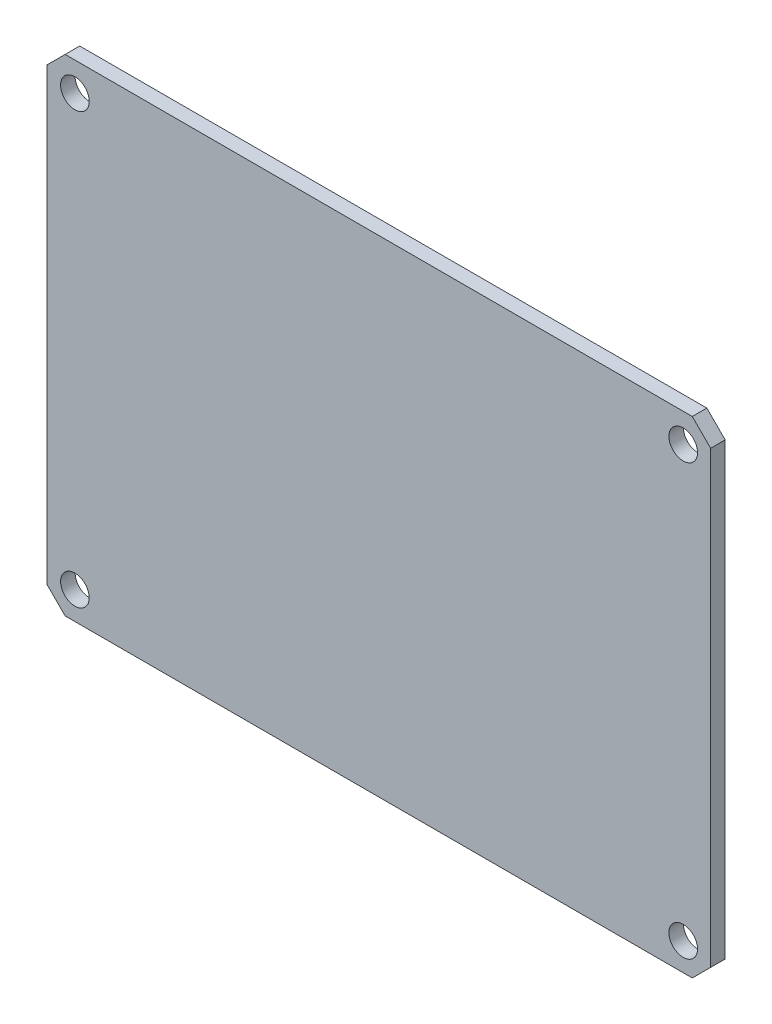
ISO-10303-21;
HEADER;
FILE_DESCRIPTION(('STEP AP214'),'2;1');
FILE_NAME('part.step','',(''),(''),'','','');
FILE_SCHEMA(('AUTOMOTIVE_DESIGN { 1 0 10303 214 1 1 1 1 }'));
ENDSEC;
DATA;
#1=APPLICATION_CONTEXT('core data for automotive mechanical design processes');
#2=APPLICATION_PROTOCOL_DEFINITION('international standard','automotive_design',2000,#1);
#3=PRODUCT_CONTEXT('',#1,'mechanical');
#4=PRODUCT('Part','Part','',(#3));
#5=PRODUCT_RELATED_PRODUCT_CATEGORY('part','',(#4));
#6=PRODUCT_DEFINITION_FORMATION('','',#4);
#7=PRODUCT_DEFINITION_CONTEXT('part definition',#1,'design');
#8=PRODUCT_DEFINITION('design','',#6,#7);
#9=PRODUCT_DEFINITION_SHAPE('','',#8);
#10=(LENGTH_UNIT() NAMED_UNIT(*) SI_UNIT(.MILLI.,.METRE.));
#11=(NAMED_UNIT(*) PLANE_ANGLE_UNIT() SI_UNIT($,.RADIAN.));
#12=(NAMED_UNIT(*) SI_UNIT($,.STERADIAN.) SOLID_ANGLE_UNIT());
#13=UNCERTAINTY_MEASURE_WITH_UNIT(LENGTH_MEASURE(1.E-05),#10,'distance_accuracy_value','');
#14=(GEOMETRIC_REPRESENTATION_CONTEXT(3) GLOBAL_UNCERTAINTY_ASSIGNED_CONTEXT((#13)) GLOBAL_UNIT_ASSIGNED_CONTEXT((#10,
#11,#12)) REPRESENTATION_CONTEXT('',''));
#15=CARTESIAN_POINT('',(0.,0.,0.));
#16=DIRECTION('',(0.,0.,1.));
#17=DIRECTION('',(1.,0.,0.));
#18=AXIS2_PLACEMENT_3D('',#15,#16,#17);
#19=CARTESIAN_POINT('',(0.,0.,0.065));
#20=DIRECTION('',(0.,0.,1.));
#21=DIRECTION('',(1.,0.,0.));
#22=AXIS2_PLACEMENT_3D('',#19,#20,#21);
#23=PLANE('',#22);
#24=DIRECTION('',(1.,0.,0.));
#25=VECTOR('',#24,1.);
#26=CARTESIAN_POINT('',(1.4005,-1.086,0.065));
#27=LINE('',#26,#25);
#28=CARTESIAN_POINT('',(1.4005,-1.086,0.065));
#29=VERTEX_POINT('',#28);
#30=CARTESIAN_POINT('',(-1.4005,-1.086,0.065));
#31=VERTEX_POINT('',#30);
#32=EDGE_CURVE('E372',#29,#31,#27,.F.);
#33=ORIENTED_EDGE('',*,*,#32,.F.);
#34=DIRECTION('',(0.707106781186548,0.707106781186548,0.));
#35=VECTOR('',#34,1.);
#36=CARTESIAN_POINT('',(1.4825,-1.004,0.065));
#37=LINE('',#36,#35);
#38=CARTESIAN_POINT('',(1.4825,-1.004,0.065));
#39=VERTEX_POINT('',#38);
#40=EDGE_CURVE('E368',#39,#29,#37,.F.);
#41=ORIENTED_EDGE('',*,*,#40,.F.);
#42=DIRECTION('',(0.,1.,0.));
#43=VECTOR('',#42,1.);
#44=CARTESIAN_POINT('',(1.4825,1.004,0.065));
#45=LINE('',#44,#43);
#46=CARTESIAN_POINT('',(1.4825,1.004,0.065));
#47=VERTEX_POINT('',#46);
#48=EDGE_CURVE('E364',#47,#39,#45,.F.);
#49=ORIENTED_EDGE('',*,*,#48,.F.);
#50=DIRECTION('',(-0.707106781186547,0.707106781186548,0.));
#51=VECTOR('',#50,1.);
#52=CARTESIAN_POINT('',(1.4825,1.004,0.065));
#53=LINE('',#52,#51);
#54=CARTESIAN_POINT('',(1.4005,1.086,0.065));
#55=VERTEX_POINT('',#54);
#56=EDGE_CURVE('E98',#47,#55,#53,.T.);
#57=ORIENTED_EDGE('',*,*,#56,.T.);
#58=DIRECTION('',(1.,0.,0.));
#59=VECTOR('',#58,1.);
#60=CARTESIAN_POINT('',(-1.4005,1.086,0.065));
#61=LINE('',#60,#59);
#62=CARTESIAN_POINT('',(-1.4005,1.086,0.065));
#63=VERTEX_POINT('',#62);
#64=EDGE_CURVE('E92',#63,#55,#61,.T.);
#65=ORIENTED_EDGE('',*,*,#64,.F.);
#66=DIRECTION('',(-0.707106781186548,-0.707106781186548,0.));
#67=VECTOR('',#66,1.);
#68=CARTESIAN_POINT('',(-1.4825,1.004,0.065));
#69=LINE('',#68,#67);
#70=CARTESIAN_POINT('',(-1.4825,1.004,0.065));
#71=VERTEX_POINT('',#70);
#72=EDGE_CURVE('E83',#71,#63,#69,.F.);
#73=ORIENTED_EDGE('',*,*,#72,.F.);
#74=DIRECTION('',(0.,1.,0.));
#75=VECTOR('',#74,1.);
#76=CARTESIAN_POINT('',(-1.4825,-1.004,0.065));
#77=LINE('',#76,#75);
#78=CARTESIAN_POINT('',(-1.4825,-1.004,0.065));
#79=VERTEX_POINT('',#78);
#80=EDGE_CURVE('E78',#79,#71,#77,.T.);
#81=ORIENTED_EDGE('',*,*,#80,.F.);
#82=DIRECTION('',(0.707106781186548,-0.707106781186548,0.));
#83=VECTOR('',#82,1.);
#84=CARTESIAN_POINT('',(-1.4005,-1.086,0.065));
#85=LINE('',#84,#83);
#86=EDGE_CURVE('E375',#31,#79,#85,.F.);
#87=ORIENTED_EDGE('',*,*,#86,.F.);
#88=EDGE_LOOP('',(#33,#41,#49,#57,#65,#73,#81,#87));
#89=FACE_BOUND('',#88,.T.);
#90=CARTESIAN_POINT('',(-1.357,-0.962499999999999,0.065));
#91=DIRECTION('',(0.,0.,-1.));
#92=DIRECTION('',(-1.,0.,0.));
#93=AXIS2_PLACEMENT_3D('',#90,#91,#92);
#94=CIRCLE('',#93,0.0640000000000001);
#95=CARTESIAN_POINT('',(-1.421,-0.962499999999999,0.065));
#96=VERTEX_POINT('',#95);
#97=EDGE_CURVE('E102',#96,#96,#94,.T.);
#98=ORIENTED_EDGE('',*,*,#97,.T.);
#99=EDGE_LOOP('',(#98));
#100=FACE_BOUND('',#99,.T.);
#101=CARTESIAN_POINT('',(1.36,-0.962499999999999,0.065));
#102=DIRECTION('',(0.,0.,-1.));
#103=DIRECTION('',(-1.,0.,0.));
#104=AXIS2_PLACEMENT_3D('',#101,#102,#103);
#105=CIRCLE('',#104,0.0640000000000001);
#106=CARTESIAN_POINT('',(1.296,-0.962499999999999,0.065));
#107=VERTEX_POINT('',#106);
#108=EDGE_CURVE('E127',#107,#107,#105,.T.);
#109=ORIENTED_EDGE('',*,*,#108,.T.);
#110=EDGE_LOOP('',(#109));
#111=FACE_BOUND('',#110,.T.);
#112=CARTESIAN_POINT('',(1.36,0.957500000000001,0.065));
#113=DIRECTION('',(0.,0.,-1.));
#114=DIRECTION('',(-1.,0.,0.));
#115=AXIS2_PLACEMENT_3D('',#112,#113,#114);
#116=CIRCLE('',#115,0.0640000000000001);
#117=CARTESIAN_POINT('',(1.296,0.957500000000001,0.065));
#118=VERTEX_POINT('',#117);
#119=EDGE_CURVE('E129',#118,#118,#116,.T.);
#120=ORIENTED_EDGE('',*,*,#119,.T.);
#121=EDGE_LOOP('',(#120));
#122=FACE_BOUND('',#121,.T.);
#123=CARTESIAN_POINT('',(-1.357,0.957500000000001,0.065));
#124=DIRECTION('',(0.,0.,-1.));
#125=DIRECTION('',(-1.,0.,0.));
#126=AXIS2_PLACEMENT_3D('',#123,#124,#125);
#127=CIRCLE('',#126,0.0640000000000001);
#128=CARTESIAN_POINT('',(-1.421,0.957500000000001,0.065));
#129=VERTEX_POINT('',#128);
#130=EDGE_CURVE('E20',#129,#129,#127,.T.);
#131=ORIENTED_EDGE('',*,*,#130,.T.);
#132=EDGE_LOOP('',(#131));
#133=FACE_BOUND('',#132,.T.);
#134=ADVANCED_FACE('F17',(#89,#100,#111,#122,#133),#23,.T.);
#135=CARTESIAN_POINT('',(-1.357,0.957500000000001,0.));
#136=DIRECTION('',(0.,0.,-1.));
#137=DIRECTION('',(-1.,0.,0.));
#138=AXIS2_PLACEMENT_3D('',#135,#136,#137);
#139=CYLINDRICAL_SURFACE('',#138,0.0640000000000001);
#140=ORIENTED_EDGE('',*,*,#130,.F.);
#141=EDGE_LOOP('',(#140));
#142=FACE_BOUND('',#141,.T.);
#143=CARTESIAN_POINT('',(-1.357,0.957500000000001,0.));
#144=DIRECTION('',(0.,0.,-1.));
#145=DIRECTION('',(-1.,0.,0.));
#146=AXIS2_PLACEMENT_3D('',#143,#144,#145);
#147=CIRCLE('',#146,0.0640000000000001);
#148=CARTESIAN_POINT('',(-1.421,0.957500000000001,0.));
#149=VERTEX_POINT('',#148);
#150=EDGE_CURVE('E121',#149,#149,#147,.T.);
#151=ORIENTED_EDGE('',*,*,#150,.T.);
#152=EDGE_LOOP('',(#151));
#153=FACE_BOUND('',#152,.T.);
#154=ADVANCED_FACE('F137',(#142,#153),#139,.F.);
#155=CARTESIAN_POINT('',(1.36,0.957500000000001,0.));
#156=DIRECTION('',(0.,0.,-1.));
#157=DIRECTION('',(-1.,0.,0.));
#158=AXIS2_PLACEMENT_3D('',#155,#156,#157);
#159=CYLINDRICAL_SURFACE('',#158,0.0640000000000001);
#160=ORIENTED_EDGE('',*,*,#119,.F.);
#161=EDGE_LOOP('',(#160));
#162=FACE_BOUND('',#161,.T.);
#163=CARTESIAN_POINT('',(1.36,0.957500000000001,0.));
#164=DIRECTION('',(0.,0.,-1.));
#165=DIRECTION('',(-1.,0.,0.));
#166=AXIS2_PLACEMENT_3D('',#163,#164,#165);
#167=CIRCLE('',#166,0.0640000000000001);
#168=CARTESIAN_POINT('',(1.296,0.957500000000001,0.));
#169=VERTEX_POINT('',#168);
#170=EDGE_CURVE('E118',#169,#169,#167,.T.);
#171=ORIENTED_EDGE('',*,*,#170,.T.);
#172=EDGE_LOOP('',(#171));
#173=FACE_BOUND('',#172,.T.);
#174=ADVANCED_FACE('F140',(#162,#173),#159,.F.);
#175=CARTESIAN_POINT('',(1.36,-0.962499999999999,0.));
#176=DIRECTION('',(0.,0.,-1.));
#177=DIRECTION('',(-1.,0.,0.));
#178=AXIS2_PLACEMENT_3D('',#175,#176,#177);
#179=CYLINDRICAL_SURFACE('',#178,0.0640000000000001);
#180=ORIENTED_EDGE('',*,*,#108,.F.);
#181=EDGE_LOOP('',(#180));
#182=FACE_BOUND('',#181,.T.);
#183=CARTESIAN_POINT('',(1.36,-0.962499999999999,0.));
#184=DIRECTION('',(0.,0.,-1.));
#185=DIRECTION('',(-1.,0.,0.));
#186=AXIS2_PLACEMENT_3D('',#183,#184,#185);
#187=CIRCLE('',#186,0.0640000000000001);
#188=CARTESIAN_POINT('',(1.296,-0.962499999999999,0.));
#189=VERTEX_POINT('',#188);
#190=EDGE_CURVE('E115',#189,#189,#187,.T.);
#191=ORIENTED_EDGE('',*,*,#190,.T.);
#192=EDGE_LOOP('',(#191));
#193=FACE_BOUND('',#192,.T.);
#194=ADVANCED_FACE('F182',(#182,#193),#179,.F.);
#195=CARTESIAN_POINT('',(-1.357,-0.962499999999999,0.));
#196=DIRECTION('',(0.,0.,-1.));
#197=DIRECTION('',(-1.,0.,0.));
#198=AXIS2_PLACEMENT_3D('',#195,#196,#197);
#199=CYLINDRICAL_SURFACE('',#198,0.0640000000000001);
#200=ORIENTED_EDGE('',*,*,#97,.F.);
#201=EDGE_LOOP('',(#200));
#202=FACE_BOUND('',#201,.T.);
#203=CARTESIAN_POINT('',(-1.357,-0.962499999999999,0.));
#204=DIRECTION('',(0.,0.,-1.));
#205=DIRECTION('',(-1.,0.,0.));
#206=AXIS2_PLACEMENT_3D('',#203,#204,#205);
#207=CIRCLE('',#206,0.0640000000000001);
#208=CARTESIAN_POINT('',(-1.421,-0.962499999999999,0.));
#209=VERTEX_POINT('',#208);
#210=EDGE_CURVE('E112',#209,#209,#207,.T.);
#211=ORIENTED_EDGE('',*,*,#210,.T.);
#212=EDGE_LOOP('',(#211));
#213=FACE_BOUND('',#212,.T.);
#214=ADVANCED_FACE('F179',(#202,#213),#199,.F.);
#215=CARTESIAN_POINT('',(-1.4005,1.086,0.));
#216=DIRECTION('',(0.,1.,0.));
#217=DIRECTION('',(0.,0.,1.));
#218=AXIS2_PLACEMENT_3D('',#215,#216,#217);
#219=PLANE('',#218);
#220=DIRECTION('',(1.,0.,0.));
#221=VECTOR('',#220,1.);
#222=CARTESIAN_POINT('',(0.,1.086,0.));
#223=LINE('',#222,#221);
#224=CARTESIAN_POINT('',(1.4005,1.086,0.));
#225=VERTEX_POINT('',#224);
#226=CARTESIAN_POINT('',(-1.4005,1.086,0.));
#227=VERTEX_POINT('',#226);
#228=EDGE_CURVE('E106',#225,#227,#223,.F.);
#229=ORIENTED_EDGE('',*,*,#228,.T.);
#230=DIRECTION('',(0.,0.,1.));
#231=VECTOR('',#230,1.);
#232=CARTESIAN_POINT('',(-1.4005,1.086,0.));
#233=LINE('',#232,#231);
#234=EDGE_CURVE('E88',#63,#227,#233,.F.);
#235=ORIENTED_EDGE('',*,*,#234,.F.);
#236=ORIENTED_EDGE('',*,*,#64,.T.);
#237=DIRECTION('',(0.,0.,1.));
#238=VECTOR('',#237,1.);
#239=CARTESIAN_POINT('',(1.4005,1.086,0.));
#240=LINE('',#239,#238);
#241=EDGE_CURVE('E124',#225,#55,#240,.T.);
#242=ORIENTED_EDGE('',*,*,#241,.F.);
#243=EDGE_LOOP('',(#229,#235,#236,#242));
#244=FACE_BOUND('',#243,.T.);
#245=ADVANCED_FACE('F105',(#244),#219,.T.);
#246=CARTESIAN_POINT('',(-1.4825,1.004,0.));
#247=DIRECTION('',(-0.707106781186548,0.707106781186548,0.));
#248=DIRECTION('',(-0.707106781186548,-0.707106781186548,0.));
#249=AXIS2_PLACEMENT_3D('',#246,#247,#248);
#250=PLANE('',#249);
#251=DIRECTION('',(-0.707106781186547,-0.707106781186548,0.));
#252=VECTOR('',#251,1.);
#253=CARTESIAN_POINT('',(-1.4005,1.086,0.));
#254=LINE('',#253,#252);
#255=CARTESIAN_POINT('',(-1.4825,1.004,0.));
#256=VERTEX_POINT('',#255);
#257=EDGE_CURVE('E351',#227,#256,#254,.T.);
#258=ORIENTED_EDGE('',*,*,#257,.T.);
#259=DIRECTION('',(0.,0.,1.));
#260=VECTOR('',#259,1.);
#261=CARTESIAN_POINT('',(-1.4825,1.004,0.));
#262=LINE('',#261,#260);
#263=EDGE_CURVE('E90',#71,#256,#262,.F.);
#264=ORIENTED_EDGE('',*,*,#263,.F.);
#265=ORIENTED_EDGE('',*,*,#72,.T.);
#266=ORIENTED_EDGE('',*,*,#234,.T.);
#267=EDGE_LOOP('',(#258,#264,#265,#266));
#268=FACE_BOUND('',#267,.T.);
#269=ADVANCED_FACE('F86',(#268),#250,.T.);
#270=CARTESIAN_POINT('',(-1.4825,-1.004,0.));
#271=DIRECTION('',(-1.,0.,0.));
#272=DIRECTION('',(0.,0.,1.));
#273=AXIS2_PLACEMENT_3D('',#270,#271,#272);
#274=PLANE('',#273);
#275=DIRECTION('',(0.,1.,0.));
#276=VECTOR('',#275,1.);
#277=CARTESIAN_POINT('',(-1.4825,0.,0.));
#278=LINE('',#277,#276);
#279=CARTESIAN_POINT('',(-1.4825,-1.004,0.));
#280=VERTEX_POINT('',#279);
#281=EDGE_CURVE('E347',#256,#280,#278,.F.);
#282=ORIENTED_EDGE('',*,*,#281,.T.);
#283=DIRECTION('',(0.,0.,1.));
#284=VECTOR('',#283,1.);
#285=CARTESIAN_POINT('',(-1.4825,-1.004,0.));
#286=LINE('',#285,#284);
#287=EDGE_CURVE('E348',#79,#280,#286,.F.);
#288=ORIENTED_EDGE('',*,*,#287,.F.);
#289=ORIENTED_EDGE('',*,*,#80,.T.);
#290=ORIENTED_EDGE('',*,*,#263,.T.);
#291=EDGE_LOOP('',(#282,#288,#289,#290));
#292=FACE_BOUND('',#291,.T.);
#293=ADVANCED_FACE('F171',(#292),#274,.T.);
#294=CARTESIAN_POINT('',(-1.4005,-1.086,0.));
#295=DIRECTION('',(-0.707106781186548,-0.707106781186548,0.));
#296=DIRECTION('',(0.707106781186548,-0.707106781186548,0.));
#297=AXIS2_PLACEMENT_3D('',#294,#295,#296);
#298=PLANE('',#297);
#299=DIRECTION('',(0.707106781186547,-0.707106781186548,0.));
#300=VECTOR('',#299,1.);
#301=CARTESIAN_POINT('',(-1.4825,-1.004,0.));
#302=LINE('',#301,#300);
#303=CARTESIAN_POINT('',(-1.4005,-1.086,0.));
#304=VERTEX_POINT('',#303);
#305=EDGE_CURVE('E350',#280,#304,#302,.T.);
#306=ORIENTED_EDGE('',*,*,#305,.T.);
#307=DIRECTION('',(0.,0.,-1.));
#308=VECTOR('',#307,1.);
#309=CARTESIAN_POINT('',(-1.4005,-1.086,0.));
#310=LINE('',#309,#308);
#311=EDGE_CURVE('E370',#31,#304,#310,.T.);
#312=ORIENTED_EDGE('',*,*,#311,.F.);
#313=ORIENTED_EDGE('',*,*,#86,.T.);
#314=ORIENTED_EDGE('',*,*,#287,.T.);
#315=EDGE_LOOP('',(#306,#312,#313,#314));
#316=FACE_BOUND('',#315,.T.);
#317=ADVANCED_FACE('F167',(#316),#298,.T.);
#318=CARTESIAN_POINT('',(1.4005,-1.086,0.));
#319=DIRECTION('',(0.,-1.,0.));
#320=DIRECTION('',(0.,0.,-1.));
#321=AXIS2_PLACEMENT_3D('',#318,#319,#320);
#322=PLANE('',#321);
#323=DIRECTION('',(1.,0.,0.));
#324=VECTOR('',#323,1.);
#325=CARTESIAN_POINT('',(0.,-1.086,0.));
#326=LINE('',#325,#324);
#327=CARTESIAN_POINT('',(1.4005,-1.086,0.));
#328=VERTEX_POINT('',#327);
#329=EDGE_CURVE('E354',#304,#328,#326,.T.);
#330=ORIENTED_EDGE('',*,*,#329,.T.);
#331=DIRECTION('',(0.,0.,1.));
#332=VECTOR('',#331,1.);
#333=CARTESIAN_POINT('',(1.4005,-1.086,0.));
#334=LINE('',#333,#332);
#335=EDGE_CURVE('E366',#29,#328,#334,.F.);
#336=ORIENTED_EDGE('',*,*,#335,.F.);
#337=ORIENTED_EDGE('',*,*,#32,.T.);
#338=ORIENTED_EDGE('',*,*,#311,.T.);
#339=EDGE_LOOP('',(#330,#336,#337,#338));
#340=FACE_BOUND('',#339,.T.);
#341=ADVANCED_FACE('F163',(#340),#322,.T.);
#342=CARTESIAN_POINT('',(1.4825,-1.004,0.));
#343=DIRECTION('',(0.707106781186548,-0.707106781186548,0.));
#344=DIRECTION('',(0.707106781186548,0.707106781186548,0.));
#345=AXIS2_PLACEMENT_3D('',#342,#343,#344);
#346=PLANE('',#345);
#347=DIRECTION('',(0.707106781186547,0.707106781186548,0.));
#348=VECTOR('',#347,1.);
#349=CARTESIAN_POINT('',(1.4005,-1.086,0.));
#350=LINE('',#349,#348);
#351=CARTESIAN_POINT('',(1.4825,-1.004,0.));
#352=VERTEX_POINT('',#351);
#353=EDGE_CURVE('E385',#328,#352,#350,.T.);
#354=ORIENTED_EDGE('',*,*,#353,.T.);
#355=DIRECTION('',(0.,0.,-1.));
#356=VECTOR('',#355,1.);
#357=CARTESIAN_POINT('',(1.4825,-1.004,0.));
#358=LINE('',#357,#356);
#359=EDGE_CURVE('E362',#39,#352,#358,.T.);
#360=ORIENTED_EDGE('',*,*,#359,.F.);
#361=ORIENTED_EDGE('',*,*,#40,.T.);
#362=ORIENTED_EDGE('',*,*,#335,.T.);
#363=EDGE_LOOP('',(#354,#360,#361,#362));
#364=FACE_BOUND('',#363,.T.);
#365=ADVANCED_FACE('F159',(#364),#346,.T.);
#366=CARTESIAN_POINT('',(1.4825,1.004,0.));
#367=DIRECTION('',(1.,0.,0.));
#368=DIRECTION('',(0.,0.,-1.));
#369=AXIS2_PLACEMENT_3D('',#366,#367,#368);
#370=PLANE('',#369);
#371=DIRECTION('',(0.,1.,0.));
#372=VECTOR('',#371,1.);
#373=CARTESIAN_POINT('',(1.4825,0.,0.));
#374=LINE('',#373,#372);
#375=CARTESIAN_POINT('',(1.4825,1.004,0.));
#376=VERTEX_POINT('',#375);
#377=EDGE_CURVE('E26',#352,#376,#374,.T.);
#378=ORIENTED_EDGE('',*,*,#377,.T.);
#379=DIRECTION('',(0.,0.,1.));
#380=VECTOR('',#379,1.);
#381=CARTESIAN_POINT('',(1.4825,1.004,0.));
#382=LINE('',#381,#380);
#383=EDGE_CURVE('E34',#47,#376,#382,.F.);
#384=ORIENTED_EDGE('',*,*,#383,.F.);
#385=ORIENTED_EDGE('',*,*,#48,.T.);
#386=ORIENTED_EDGE('',*,*,#359,.T.);
#387=EDGE_LOOP('',(#378,#384,#385,#386));
#388=FACE_BOUND('',#387,.T.);
#389=ADVANCED_FACE('F152',(#388),#370,.T.);
#390=CARTESIAN_POINT('',(1.4005,1.086,0.));
#391=DIRECTION('',(0.707106781186548,0.707106781186548,0.));
#392=DIRECTION('',(-0.707106781186548,0.707106781186548,0.));
#393=AXIS2_PLACEMENT_3D('',#390,#391,#392);
#394=PLANE('',#393);
#395=DIRECTION('',(-0.707106781186547,0.707106781186548,0.));
#396=VECTOR('',#395,1.);
#397=CARTESIAN_POINT('',(1.4825,1.004,0.));
#398=LINE('',#397,#396);
#399=EDGE_CURVE('E11',#376,#225,#398,.T.);
#400=ORIENTED_EDGE('',*,*,#399,.T.);
#401=ORIENTED_EDGE('',*,*,#241,.T.);
#402=ORIENTED_EDGE('',*,*,#56,.F.);
#403=ORIENTED_EDGE('',*,*,#383,.T.);
#404=EDGE_LOOP('',(#400,#401,#402,#403));
#405=FACE_BOUND('',#404,.T.);
#406=ADVANCED_FACE('F145',(#405),#394,.T.);
#407=CARTESIAN_POINT('',(0.,0.,0.));
#408=DIRECTION('',(0.,0.,1.));
#409=DIRECTION('',(1.,0.,0.));
#410=AXIS2_PLACEMENT_3D('',#407,#408,#409);
#411=PLANE('',#410);
#412=ORIENTED_EDGE('',*,*,#377,.F.);
#413=ORIENTED_EDGE('',*,*,#353,.F.);
#414=ORIENTED_EDGE('',*,*,#329,.F.);
#415=ORIENTED_EDGE('',*,*,#305,.F.);
#416=ORIENTED_EDGE('',*,*,#281,.F.);
#417=ORIENTED_EDGE('',*,*,#257,.F.);
#418=ORIENTED_EDGE('',*,*,#228,.F.);
#419=ORIENTED_EDGE('',*,*,#399,.F.);
#420=EDGE_LOOP('',(#412,#413,#414,#415,#416,#417,#418,#419));
#421=FACE_BOUND('',#420,.T.);
#422=ORIENTED_EDGE('',*,*,#210,.F.);
#423=EDGE_LOOP('',(#422));
#424=FACE_BOUND('',#423,.T.);
#425=ORIENTED_EDGE('',*,*,#190,.F.);
#426=EDGE_LOOP('',(#425));
#427=FACE_BOUND('',#426,.T.);
#428=ORIENTED_EDGE('',*,*,#170,.F.);
#429=EDGE_LOOP('',(#428));
#430=FACE_BOUND('',#429,.T.);
#431=ORIENTED_EDGE('',*,*,#150,.F.);
#432=EDGE_LOOP('',(#431));
#433=FACE_BOUND('',#432,.T.);
#434=ADVANCED_FACE('F143',(#421,#424,#427,#430,#433),#411,.F.);
#435=CLOSED_SHELL('',(#134,#154,#174,#194,#214,#245,#269,#293,#317,#341,#365,#389,#406,#434));
#436=MANIFOLD_SOLID_BREP('B1',#435);
#437=ADVANCED_BREP_SHAPE_REPRESENTATION('',(#18,#436),#14);
#438=SHAPE_DEFINITION_REPRESENTATION(#9,#437);
ENDSEC;
END-ISO-10303-21;
